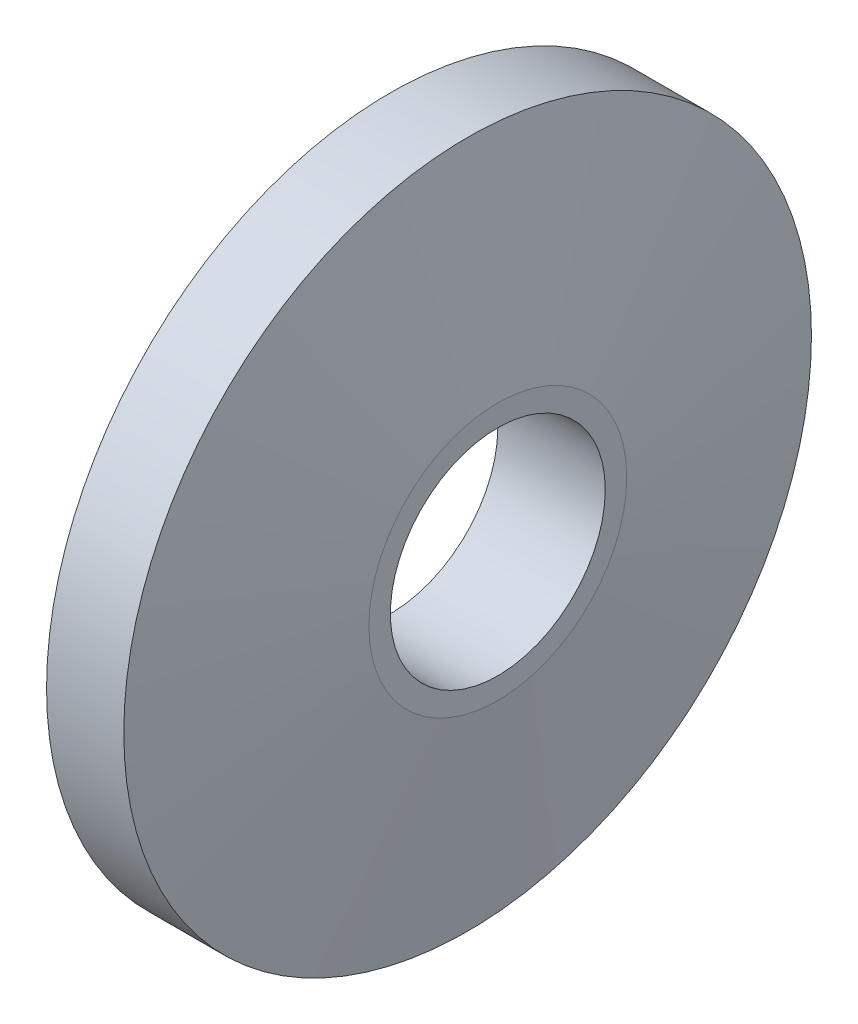
ISO-10303-21;
HEADER;
FILE_DESCRIPTION(('STEP AP214'),'2;1');
FILE_NAME('part.step','',(''),(''),'','','');
FILE_SCHEMA(('AUTOMOTIVE_DESIGN { 1 0 10303 214 1 1 1 1 }'));
ENDSEC;
DATA;
#1=APPLICATION_CONTEXT('core data for automotive mechanical design processes');
#2=APPLICATION_PROTOCOL_DEFINITION('international standard','automotive_design',2000,#1);
#3=PRODUCT_CONTEXT('',#1,'mechanical');
#4=PRODUCT('Part','Part','',(#3));
#5=PRODUCT_RELATED_PRODUCT_CATEGORY('part','',(#4));
#6=PRODUCT_DEFINITION_FORMATION('','',#4);
#7=PRODUCT_DEFINITION_CONTEXT('part definition',#1,'design');
#8=PRODUCT_DEFINITION('design','',#6,#7);
#9=PRODUCT_DEFINITION_SHAPE('','',#8);
#10=(LENGTH_UNIT() NAMED_UNIT(*) SI_UNIT(.MILLI.,.METRE.));
#11=(NAMED_UNIT(*) PLANE_ANGLE_UNIT() SI_UNIT($,.RADIAN.));
#12=(NAMED_UNIT(*) SI_UNIT($,.STERADIAN.) SOLID_ANGLE_UNIT());
#13=UNCERTAINTY_MEASURE_WITH_UNIT(LENGTH_MEASURE(1.E-05),#10,'distance_accuracy_value','');
#14=(GEOMETRIC_REPRESENTATION_CONTEXT(3) GLOBAL_UNCERTAINTY_ASSIGNED_CONTEXT((#13)) GLOBAL_UNIT_ASSIGNED_CONTEXT((#10,
#11,#12)) REPRESENTATION_CONTEXT('',''));
#15=CARTESIAN_POINT('',(0.,0.,0.));
#16=DIRECTION('',(0.,0.,1.));
#17=DIRECTION('',(1.,0.,0.));
#18=AXIS2_PLACEMENT_3D('',#15,#16,#17);
#19=CARTESIAN_POINT('',(0.,0.,0.));
#20=DIRECTION('',(1.,0.,0.));
#21=DIRECTION('',(0.,0.,-1.));
#22=AXIS2_PLACEMENT_3D('',#19,#20,#21);
#23=PLANE('',#22);
#24=CARTESIAN_POINT('',(0.,0.,0.));
#25=DIRECTION('',(1.,0.,0.));
#26=DIRECTION('',(0.,0.,-1.));
#27=AXIS2_PLACEMENT_3D('',#24,#25,#26);
#28=CIRCLE('',#27,2.5);
#29=CARTESIAN_POINT('',(0.,0.,-2.5));
#30=VERTEX_POINT('',#29);
#31=EDGE_CURVE('E51',#30,#30,#28,.T.);
#32=ORIENTED_EDGE('',*,*,#31,.T.);
#33=EDGE_LOOP('',(#32));
#34=FACE_BOUND('',#33,.T.);
#35=CARTESIAN_POINT('',(0.,0.,0.));
#36=DIRECTION('',(-1.,0.,0.));
#37=DIRECTION('',(0.,0.,1.));
#38=AXIS2_PLACEMENT_3D('',#35,#36,#37);
#39=CIRCLE('',#38,8.);
#40=CARTESIAN_POINT('',(0.,0.,8.));
#41=VERTEX_POINT('',#40);
#42=EDGE_CURVE('E10',#41,#41,#39,.T.);
#43=ORIENTED_EDGE('',*,*,#42,.T.);
#44=EDGE_LOOP('',(#43));
#45=FACE_BOUND('',#44,.T.);
#46=ADVANCED_FACE('F37',(#34,#45),#23,.F.);
#47=CARTESIAN_POINT('',(-13.2765957446808,0.,0.));
#48=DIRECTION('',(-1.,0.,0.));
#49=DIRECTION('',(0.,0.,1.));
#50=AXIS2_PLACEMENT_3D('',#47,#48,#49);
#51=CYLINDRICAL_SURFACE('',#50,8.);
#52=ORIENTED_EDGE('',*,*,#42,.F.);
#53=EDGE_LOOP('',(#52));
#54=FACE_BOUND('',#53,.T.);
#55=CARTESIAN_POINT('',(1.79729582648804,0.,0.));
#56=DIRECTION('',(-1.,0.,0.));
#57=DIRECTION('',(0.,0.,1.));
#58=AXIS2_PLACEMENT_3D('',#55,#56,#57);
#59=CIRCLE('',#58,8.);
#60=CARTESIAN_POINT('',(1.79729582648804,0.,8.));
#61=VERTEX_POINT('',#60);
#62=EDGE_CURVE('E43',#61,#61,#59,.T.);
#63=ORIENTED_EDGE('',*,*,#62,.T.);
#64=EDGE_LOOP('',(#63));
#65=FACE_BOUND('',#64,.T.);
#66=ADVANCED_FACE('F75',(#54,#65),#51,.T.);
#67=CARTESIAN_POINT('',(2.5,0.,0.));
#68=DIRECTION('',(-1.,0.,0.));
#69=DIRECTION('',(0.,0.,1.));
#70=AXIS2_PLACEMENT_3D('',#67,#68,#69);
#71=CONICAL_SURFACE('',#70,3.,1.43116998663535);
#72=ORIENTED_EDGE('',*,*,#62,.F.);
#73=EDGE_LOOP('',(#72));
#74=FACE_BOUND('',#73,.T.);
#75=CARTESIAN_POINT('',(2.5,0.,0.));
#76=DIRECTION('',(-1.,0.,0.));
#77=DIRECTION('',(0.,0.,1.));
#78=AXIS2_PLACEMENT_3D('',#75,#76,#77);
#79=CIRCLE('',#78,3.);
#80=CARTESIAN_POINT('',(2.5,0.,3.));
#81=VERTEX_POINT('',#80);
#82=EDGE_CURVE('E47',#81,#81,#79,.T.);
#83=ORIENTED_EDGE('',*,*,#82,.T.);
#84=EDGE_LOOP('',(#83));
#85=FACE_BOUND('',#84,.T.);
#86=ADVANCED_FACE('F70',(#74,#85),#71,.T.);
#87=CARTESIAN_POINT('',(2.5,3.,0.));
#88=DIRECTION('',(-1.,0.,0.));
#89=DIRECTION('',(0.,0.,1.));
#90=AXIS2_PLACEMENT_3D('',#87,#88,#89);
#91=PLANE('',#90);
#92=CARTESIAN_POINT('',(2.5,0.,0.));
#93=DIRECTION('',(1.,0.,0.));
#94=DIRECTION('',(0.,0.,-1.));
#95=AXIS2_PLACEMENT_3D('',#92,#93,#94);
#96=CIRCLE('',#95,2.5);
#97=CARTESIAN_POINT('',(2.5,0.,-2.5));
#98=VERTEX_POINT('',#97);
#99=EDGE_CURVE('E54',#98,#98,#96,.T.);
#100=ORIENTED_EDGE('',*,*,#99,.F.);
#101=EDGE_LOOP('',(#100));
#102=FACE_BOUND('',#101,.T.);
#103=ORIENTED_EDGE('',*,*,#82,.F.);
#104=EDGE_LOOP('',(#103));
#105=FACE_BOUND('',#104,.T.);
#106=ADVANCED_FACE('F64',(#102,#105),#91,.F.);
#107=CARTESIAN_POINT('',(0.,0.,0.));
#108=DIRECTION('',(1.,0.,0.));
#109=DIRECTION('',(0.,0.,-1.));
#110=AXIS2_PLACEMENT_3D('',#107,#108,#109);
#111=CYLINDRICAL_SURFACE('',#110,2.5);
#112=ORIENTED_EDGE('',*,*,#31,.F.);
#113=EDGE_LOOP('',(#112));
#114=FACE_BOUND('',#113,.T.);
#115=ORIENTED_EDGE('',*,*,#99,.T.);
#116=EDGE_LOOP('',(#115));
#117=FACE_BOUND('',#116,.T.);
#118=ADVANCED_FACE('F61',(#114,#117),#111,.F.);
#119=CLOSED_SHELL('',(#46,#66,#86,#106,#118));
#120=MANIFOLD_SOLID_BREP('B2',#119);
#121=ADVANCED_BREP_SHAPE_REPRESENTATION('',(#18,#120),#14);
#122=SHAPE_DEFINITION_REPRESENTATION(#9,#121);
ENDSEC;
END-ISO-10303-21;
